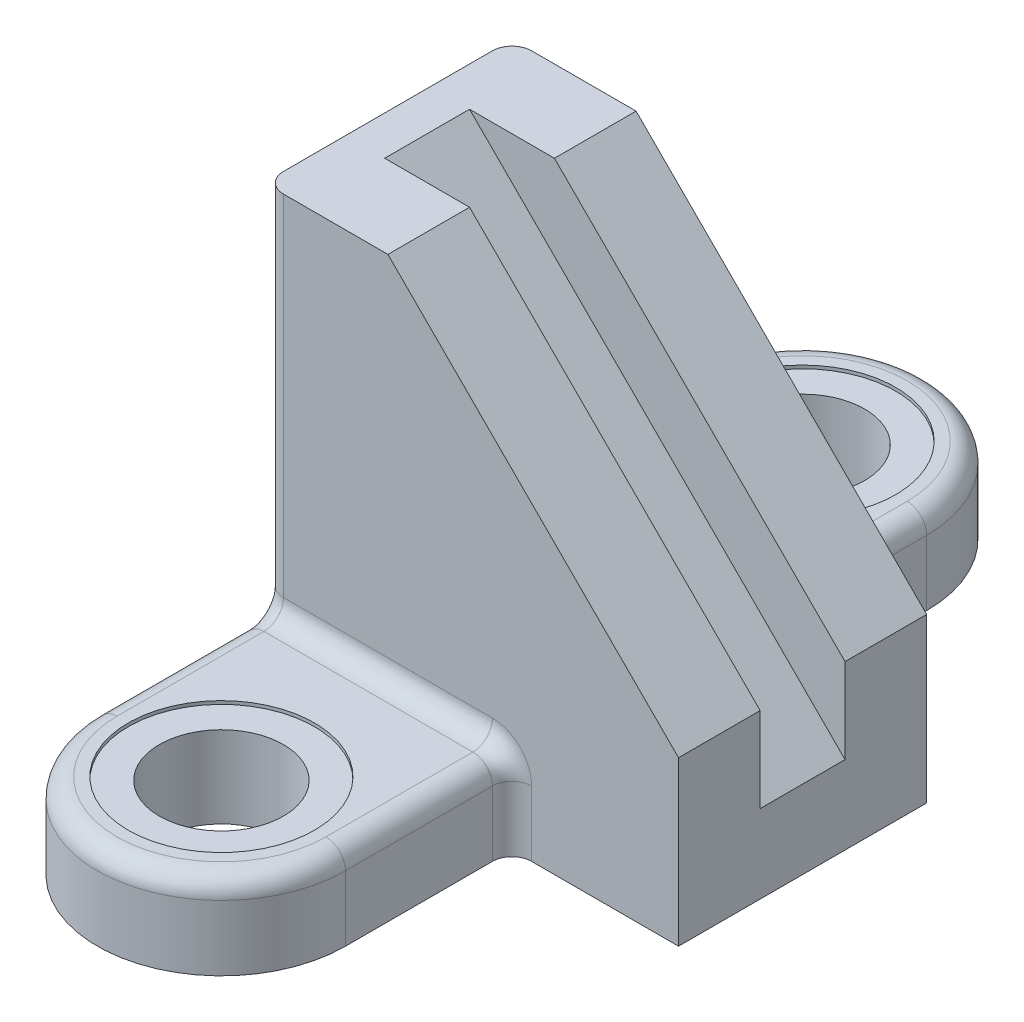
ISO-10303-21;
HEADER;
FILE_DESCRIPTION(('STEP AP214'),'2;1');
FILE_NAME('part.step','',(''),(''),'','','');
FILE_SCHEMA(('AUTOMOTIVE_DESIGN { 1 0 10303 214 1 1 1 1 }'));
ENDSEC;
DATA;
#1=APPLICATION_CONTEXT('core data for automotive mechanical design processes');
#2=APPLICATION_PROTOCOL_DEFINITION('international standard','automotive_design',2000,#1);
#3=PRODUCT_CONTEXT('',#1,'mechanical');
#4=PRODUCT('Part','Part','',(#3));
#5=PRODUCT_RELATED_PRODUCT_CATEGORY('part','',(#4));
#6=PRODUCT_DEFINITION_FORMATION('','',#4);
#7=PRODUCT_DEFINITION_CONTEXT('part definition',#1,'design');
#8=PRODUCT_DEFINITION('design','',#6,#7);
#9=PRODUCT_DEFINITION_SHAPE('','',#8);
#10=(LENGTH_UNIT() NAMED_UNIT(*) SI_UNIT(.MILLI.,.METRE.));
#11=(NAMED_UNIT(*) PLANE_ANGLE_UNIT() SI_UNIT($,.RADIAN.));
#12=(NAMED_UNIT(*) SI_UNIT($,.STERADIAN.) SOLID_ANGLE_UNIT());
#13=UNCERTAINTY_MEASURE_WITH_UNIT(LENGTH_MEASURE(1.E-05),#10,'distance_accuracy_value','');
#14=(GEOMETRIC_REPRESENTATION_CONTEXT(3) GLOBAL_UNCERTAINTY_ASSIGNED_CONTEXT((#13)) GLOBAL_UNIT_ASSIGNED_CONTEXT((#10,
#11,#12)) REPRESENTATION_CONTEXT('',''));
#15=CARTESIAN_POINT('',(0.,0.,0.));
#16=DIRECTION('',(0.,0.,1.));
#17=DIRECTION('',(1.,0.,0.));
#18=AXIS2_PLACEMENT_3D('',#15,#16,#17);
#19=CARTESIAN_POINT('',(38.,138.999999999999,38.));
#20=DIRECTION('',(-0.707106781186544,-0.707106781186551,0.));
#21=DIRECTION('',(0.707106781186551,-0.707106781186544,0.));
#22=AXIS2_PLACEMENT_3D('',#19,#20,#21);
#23=PLANE('',#22);
#24=DIRECTION('',(0.,0.,-1.));
#25=VECTOR('',#24,1.);
#26=CARTESIAN_POINT('',(127.,50.,38.));
#27=LINE('',#26,#25);
#28=CARTESIAN_POINT('',(127.,50.,38.));
#29=VERTEX_POINT('',#28);
#30=CARTESIAN_POINT('',(127.,49.9999999999997,13.));
#31=VERTEX_POINT('',#30);
#32=EDGE_CURVE('E232',#29,#31,#27,.T.);
#33=ORIENTED_EDGE('',*,*,#32,.T.);
#34=DIRECTION('',(-0.707106781186549,0.707106781186546,0.));
#35=VECTOR('',#34,1.);
#36=CARTESIAN_POINT('',(152.,24.9999999999998,13.));
#37=LINE('',#36,#35);
#38=CARTESIAN_POINT('',(38.0000000000001,138.999999999999,13.));
#39=VERTEX_POINT('',#38);
#40=EDGE_CURVE('E218',#31,#39,#37,.T.);
#41=ORIENTED_EDGE('',*,*,#40,.T.);
#42=DIRECTION('',(0.,0.,-1.));
#43=VECTOR('',#42,1.);
#44=CARTESIAN_POINT('',(38.,138.999999999999,38.));
#45=LINE('',#44,#43);
#46=CARTESIAN_POINT('',(38.,138.999999999999,38.));
#47=VERTEX_POINT('',#46);
#48=EDGE_CURVE('E224',#47,#39,#45,.T.);
#49=ORIENTED_EDGE('',*,*,#48,.F.);
#50=DIRECTION('',(-0.707106781186551,0.707106781186544,0.));
#51=VECTOR('',#50,1.);
#52=CARTESIAN_POINT('',(38.,138.999999999999,38.));
#53=LINE('',#52,#51);
#54=EDGE_CURVE('E393',#29,#47,#53,.T.);
#55=ORIENTED_EDGE('',*,*,#54,.F.);
#56=EDGE_LOOP('',(#33,#41,#49,#55));
#57=FACE_BOUND('',#56,.T.);
#58=ADVANCED_FACE('F37',(#57),#23,.F.);
#59=CARTESIAN_POINT('',(0.,0.,38.));
#60=DIRECTION('',(0.,0.,-1.));
#61=DIRECTION('',(-1.,0.,0.));
#62=AXIS2_PLACEMENT_3D('',#59,#60,#61);
#63=PLANE('',#62);
#64=CARTESIAN_POINT('',(70.,20.,38.));
#65=DIRECTION('',(0.,0.,-1.));
#66=DIRECTION('',(-1.,0.,0.));
#67=AXIS2_PLACEMENT_3D('',#64,#65,#66);
#68=CIRCLE('',#67,12.);
#69=CARTESIAN_POINT('',(82.,20.,38.));
#70=VERTEX_POINT('',#69);
#71=CARTESIAN_POINT('',(70.,32.,38.));
#72=VERTEX_POINT('',#71);
#73=EDGE_CURVE('E263',#70,#72,#68,.F.);
#74=ORIENTED_EDGE('',*,*,#73,.F.);
#75=DIRECTION('',(0.,-1.,0.));
#76=VECTOR('',#75,1.);
#77=CARTESIAN_POINT('',(82.,0.,38.));
#78=LINE('',#77,#76);
#79=CARTESIAN_POINT('',(82.,0.,38.));
#80=VERTEX_POINT('',#79);
#81=EDGE_CURVE('E266',#70,#80,#78,.T.);
#82=ORIENTED_EDGE('',*,*,#81,.T.);
#83=DIRECTION('',(1.,0.,0.));
#84=VECTOR('',#83,1.);
#85=CARTESIAN_POINT('',(0.,0.,38.));
#86=LINE('',#85,#84);
#87=CARTESIAN_POINT('',(127.,0.,38.));
#88=VERTEX_POINT('',#87);
#89=EDGE_CURVE('E384',#80,#88,#86,.T.);
#90=ORIENTED_EDGE('',*,*,#89,.T.);
#91=DIRECTION('',(0.,1.,0.));
#92=VECTOR('',#91,1.);
#93=CARTESIAN_POINT('',(127.,0.,38.));
#94=LINE('',#93,#92);
#95=EDGE_CURVE('E385',#88,#29,#94,.T.);
#96=ORIENTED_EDGE('',*,*,#95,.T.);
#97=ORIENTED_EDGE('',*,*,#54,.T.);
#98=DIRECTION('',(-1.,0.,0.));
#99=VECTOR('',#98,1.);
#100=CARTESIAN_POINT('',(0.,138.999999999999,38.));
#101=LINE('',#100,#99);
#102=CARTESIAN_POINT('',(6.,138.999999999999,38.));
#103=VERTEX_POINT('',#102);
#104=EDGE_CURVE('E226',#47,#103,#101,.T.);
#105=ORIENTED_EDGE('',*,*,#104,.T.);
#106=DIRECTION('',(0.,-1.,0.));
#107=VECTOR('',#106,1.);
#108=CARTESIAN_POINT('',(6.,0.,38.));
#109=LINE('',#108,#107);
#110=CARTESIAN_POINT('',(6.,32.,38.));
#111=VERTEX_POINT('',#110);
#112=EDGE_CURVE('E259',#103,#111,#109,.T.);
#113=ORIENTED_EDGE('',*,*,#112,.T.);
#114=DIRECTION('',(-1.,0.,0.));
#115=VECTOR('',#114,1.);
#116=CARTESIAN_POINT('',(0.,32.,38.));
#117=LINE('',#116,#115);
#118=EDGE_CURVE('E261',#111,#72,#117,.F.);
#119=ORIENTED_EDGE('',*,*,#118,.T.);
#120=EDGE_LOOP('',(#74,#82,#90,#96,#97,#105,#113,#119));
#121=FACE_BOUND('',#120,.T.);
#122=ADVANCED_FACE('F491',(#121),#63,.F.);
#123=CARTESIAN_POINT('',(0.,0.,38.));
#124=DIRECTION('',(1.,0.,0.));
#125=DIRECTION('',(0.,0.,-1.));
#126=AXIS2_PLACEMENT_3D('',#123,#124,#125);
#127=PLANE('',#126);
#128=CARTESIAN_POINT('',(0.,32.,-44.));
#129=DIRECTION('',(1.,0.,0.));
#130=DIRECTION('',(0.,0.,-1.));
#131=AXIS2_PLACEMENT_3D('',#128,#129,#130);
#132=CIRCLE('',#131,12.);
#133=CARTESIAN_POINT('',(0.,20.,-44.));
#134=VERTEX_POINT('',#133);
#135=CARTESIAN_POINT('',(0.,32.,-32.));
#136=VERTEX_POINT('',#135);
#137=EDGE_CURVE('E289',#134,#136,#132,.F.);
#138=ORIENTED_EDGE('',*,*,#137,.F.);
#139=DIRECTION('',(0.,0.,1.));
#140=VECTOR('',#139,1.);
#141=CARTESIAN_POINT('',(0.,20.,38.));
#142=LINE('',#141,#140);
#143=CARTESIAN_POINT('',(0.,20.,-89.));
#144=VERTEX_POINT('',#143);
#145=EDGE_CURVE('E294',#134,#144,#142,.F.);
#146=ORIENTED_EDGE('',*,*,#145,.T.);
#147=DIRECTION('',(0.,-1.,0.));
#148=VECTOR('',#147,1.);
#149=CARTESIAN_POINT('',(0.,26.,-89.));
#150=LINE('',#149,#148);
#151=CARTESIAN_POINT('',(0.,0.,-89.));
#152=VERTEX_POINT('',#151);
#153=EDGE_CURVE('E397',#144,#152,#150,.T.);
#154=ORIENTED_EDGE('',*,*,#153,.T.);
#155=DIRECTION('',(0.,0.,-1.));
#156=VECTOR('',#155,1.);
#157=CARTESIAN_POINT('',(0.,0.,38.));
#158=LINE('',#157,#156);
#159=CARTESIAN_POINT('',(0.,0.,89.));
#160=VERTEX_POINT('',#159);
#161=EDGE_CURVE('E242',#160,#152,#158,.T.);
#162=ORIENTED_EDGE('',*,*,#161,.F.);
#163=DIRECTION('',(0.,-1.,0.));
#164=VECTOR('',#163,1.);
#165=CARTESIAN_POINT('',(0.,26.,89.));
#166=LINE('',#165,#164);
#167=CARTESIAN_POINT('',(0.,20.,89.));
#168=VERTEX_POINT('',#167);
#169=EDGE_CURVE('E405',#168,#160,#166,.T.);
#170=ORIENTED_EDGE('',*,*,#169,.F.);
#171=DIRECTION('',(0.,0.,1.));
#172=VECTOR('',#171,1.);
#173=CARTESIAN_POINT('',(0.,20.,38.));
#174=LINE('',#173,#172);
#175=CARTESIAN_POINT('',(0.,20.,44.));
#176=VERTEX_POINT('',#175);
#177=EDGE_CURVE('E287',#168,#176,#174,.F.);
#178=ORIENTED_EDGE('',*,*,#177,.T.);
#179=CARTESIAN_POINT('',(0.,32.,44.));
#180=DIRECTION('',(1.,0.,0.));
#181=DIRECTION('',(0.,0.,-1.));
#182=AXIS2_PLACEMENT_3D('',#179,#180,#181);
#183=CIRCLE('',#182,12.);
#184=CARTESIAN_POINT('',(0.,32.,32.));
#185=VERTEX_POINT('',#184);
#186=EDGE_CURVE('E284',#185,#176,#183,.F.);
#187=ORIENTED_EDGE('',*,*,#186,.F.);
#188=DIRECTION('',(0.,-1.,0.));
#189=VECTOR('',#188,1.);
#190=CARTESIAN_POINT('',(0.,0.,32.));
#191=LINE('',#190,#189);
#192=CARTESIAN_POINT('',(0.,138.999999999999,32.));
#193=VERTEX_POINT('',#192);
#194=EDGE_CURVE('E282',#185,#193,#191,.F.);
#195=ORIENTED_EDGE('',*,*,#194,.T.);
#196=DIRECTION('',(0.,0.,-1.));
#197=VECTOR('',#196,1.);
#198=CARTESIAN_POINT('',(0.,138.999999999999,38.));
#199=LINE('',#198,#197);
#200=CARTESIAN_POINT('',(0.,138.999999999999,-32.));
#201=VERTEX_POINT('',#200);
#202=EDGE_CURVE('E234',#193,#201,#199,.T.);
#203=ORIENTED_EDGE('',*,*,#202,.T.);
#204=DIRECTION('',(0.,-1.,0.));
#205=VECTOR('',#204,1.);
#206=CARTESIAN_POINT('',(0.,26.,-32.));
#207=LINE('',#206,#205);
#208=EDGE_CURVE('E292',#201,#136,#207,.T.);
#209=ORIENTED_EDGE('',*,*,#208,.T.);
#210=EDGE_LOOP('',(#138,#146,#154,#162,#170,#178,#187,#195,#203,#209));
#211=FACE_BOUND('',#210,.T.);
#212=ADVANCED_FACE('F475',(#211),#127,.F.);
#213=CARTESIAN_POINT('',(0.,0.,38.));
#214=DIRECTION('',(0.,1.,0.));
#215=DIRECTION('',(0.,0.,1.));
#216=AXIS2_PLACEMENT_3D('',#213,#214,#215);
#217=PLANE('',#216);
#218=CARTESIAN_POINT('',(38.,0.,89.));
#219=DIRECTION('',(0.,1.,0.));
#220=DIRECTION('',(0.,0.,1.));
#221=AXIS2_PLACEMENT_3D('',#218,#219,#220);
#222=CIRCLE('',#221,19.);
#223=CARTESIAN_POINT('',(38.,0.,108.));
#224=VERTEX_POINT('',#223);
#225=EDGE_CURVE('E425',#224,#224,#222,.T.);
#226=ORIENTED_EDGE('',*,*,#225,.T.);
#227=EDGE_LOOP('',(#226));
#228=FACE_BOUND('',#227,.T.);
#229=CARTESIAN_POINT('',(38.,0.,-89.));
#230=DIRECTION('',(0.,1.,0.));
#231=DIRECTION('',(0.,0.,1.));
#232=AXIS2_PLACEMENT_3D('',#229,#230,#231);
#233=CIRCLE('',#232,19.);
#234=CARTESIAN_POINT('',(38.,0.,-70.));
#235=VERTEX_POINT('',#234);
#236=EDGE_CURVE('E344',#235,#235,#233,.T.);
#237=ORIENTED_EDGE('',*,*,#236,.T.);
#238=EDGE_LOOP('',(#237));
#239=FACE_BOUND('',#238,.T.);
#240=ORIENTED_EDGE('',*,*,#161,.T.);
#241=CARTESIAN_POINT('',(38.,0.,-89.));
#242=DIRECTION('',(0.,1.,0.));
#243=DIRECTION('',(0.,0.,-1.));
#244=AXIS2_PLACEMENT_3D('',#241,#242,#243);
#245=CIRCLE('',#244,38.);
#246=CARTESIAN_POINT('',(76.,0.,-89.));
#247=VERTEX_POINT('',#246);
#248=EDGE_CURVE('E399',#247,#152,#245,.T.);
#249=ORIENTED_EDGE('',*,*,#248,.F.);
#250=DIRECTION('',(0.,0.,-1.));
#251=VECTOR('',#250,1.);
#252=CARTESIAN_POINT('',(76.,0.,-38.));
#253=LINE('',#252,#251);
#254=CARTESIAN_POINT('',(76.,0.,-44.));
#255=VERTEX_POINT('',#254);
#256=EDGE_CURVE('E402',#255,#247,#253,.T.);
#257=ORIENTED_EDGE('',*,*,#256,.F.);
#258=CARTESIAN_POINT('',(82.,0.,-44.));
#259=DIRECTION('',(0.,1.,0.));
#260=DIRECTION('',(0.,0.,1.));
#261=AXIS2_PLACEMENT_3D('',#258,#259,#260);
#262=CIRCLE('',#261,6.);
#263=CARTESIAN_POINT('',(82.,0.,-38.));
#264=VERTEX_POINT('',#263);
#265=EDGE_CURVE('E311',#255,#264,#262,.T.);
#266=ORIENTED_EDGE('',*,*,#265,.T.);
#267=DIRECTION('',(1.,0.,0.));
#268=VECTOR('',#267,1.);
#269=CARTESIAN_POINT('',(0.,0.,-38.));
#270=LINE('',#269,#268);
#271=CARTESIAN_POINT('',(127.,0.,-38.));
#272=VERTEX_POINT('',#271);
#273=EDGE_CURVE('E389',#264,#272,#270,.T.);
#274=ORIENTED_EDGE('',*,*,#273,.T.);
#275=DIRECTION('',(0.,0.,-1.));
#276=VECTOR('',#275,1.);
#277=CARTESIAN_POINT('',(127.,0.,38.));
#278=LINE('',#277,#276);
#279=EDGE_CURVE('E239',#88,#272,#278,.T.);
#280=ORIENTED_EDGE('',*,*,#279,.F.);
#281=ORIENTED_EDGE('',*,*,#89,.F.);
#282=CARTESIAN_POINT('',(82.,0.,44.));
#283=DIRECTION('',(0.,1.,0.));
#284=DIRECTION('',(0.,0.,1.));
#285=AXIS2_PLACEMENT_3D('',#282,#283,#284);
#286=CIRCLE('',#285,6.);
#287=CARTESIAN_POINT('',(76.,0.,44.));
#288=VERTEX_POINT('',#287);
#289=EDGE_CURVE('E313',#80,#288,#286,.T.);
#290=ORIENTED_EDGE('',*,*,#289,.T.);
#291=DIRECTION('',(0.,0.,-1.));
#292=VECTOR('',#291,1.);
#293=CARTESIAN_POINT('',(76.,0.,38.));
#294=LINE('',#293,#292);
#295=CARTESIAN_POINT('',(76.,0.,89.));
#296=VERTEX_POINT('',#295);
#297=EDGE_CURVE('E409',#296,#288,#294,.T.);
#298=ORIENTED_EDGE('',*,*,#297,.F.);
#299=CARTESIAN_POINT('',(38.,0.,89.));
#300=DIRECTION('',(0.,1.,0.));
#301=DIRECTION('',(0.,0.,1.));
#302=AXIS2_PLACEMENT_3D('',#299,#300,#301);
#303=CIRCLE('',#302,38.);
#304=EDGE_CURVE('E339',#160,#296,#303,.T.);
#305=ORIENTED_EDGE('',*,*,#304,.F.);
#306=EDGE_LOOP('',(#240,#249,#257,#266,#274,#280,#281,#290,#298,#305));
#307=FACE_BOUND('',#306,.T.);
#308=ADVANCED_FACE('F507',(#228,#239,#307),#217,.F.);
#309=CARTESIAN_POINT('',(127.,0.,38.));
#310=DIRECTION('',(-1.,0.,0.));
#311=DIRECTION('',(0.,0.,1.));
#312=AXIS2_PLACEMENT_3D('',#309,#310,#311);
#313=PLANE('',#312);
#314=DIRECTION('',(0.,0.,1.));
#315=VECTOR('',#314,1.);
#316=CARTESIAN_POINT('',(127.,23.9999999999994,38.));
#317=LINE('',#316,#315);
#318=CARTESIAN_POINT('',(127.,23.9999999999995,-13.));
#319=VERTEX_POINT('',#318);
#320=CARTESIAN_POINT('',(127.,23.9999999999994,13.));
#321=VERTEX_POINT('',#320);
#322=EDGE_CURVE('E438',#319,#321,#317,.T.);
#323=ORIENTED_EDGE('',*,*,#322,.T.);
#324=DIRECTION('',(0.,1.,0.));
#325=VECTOR('',#324,1.);
#326=CARTESIAN_POINT('',(127.,0.,13.));
#327=LINE('',#326,#325);
#328=EDGE_CURVE('E209',#321,#31,#327,.T.);
#329=ORIENTED_EDGE('',*,*,#328,.T.);
#330=ORIENTED_EDGE('',*,*,#32,.F.);
#331=ORIENTED_EDGE('',*,*,#95,.F.);
#332=ORIENTED_EDGE('',*,*,#279,.T.);
#333=DIRECTION('',(0.,1.,0.));
#334=VECTOR('',#333,1.);
#335=CARTESIAN_POINT('',(127.,0.,-38.));
#336=LINE('',#335,#334);
#337=CARTESIAN_POINT('',(127.,50.,-38.));
#338=VERTEX_POINT('',#337);
#339=EDGE_CURVE('E378',#272,#338,#336,.T.);
#340=ORIENTED_EDGE('',*,*,#339,.T.);
#341=CARTESIAN_POINT('',(127.,49.9999999999997,-13.));
#342=VERTEX_POINT('',#341);
#343=EDGE_CURVE('E229',#342,#338,#27,.T.);
#344=ORIENTED_EDGE('',*,*,#343,.F.);
#345=DIRECTION('',(0.,-1.,0.));
#346=VECTOR('',#345,1.);
#347=CARTESIAN_POINT('',(127.,0.,-13.));
#348=LINE('',#347,#346);
#349=EDGE_CURVE('E211',#342,#319,#348,.T.);
#350=ORIENTED_EDGE('',*,*,#349,.T.);
#351=EDGE_LOOP('',(#323,#329,#330,#331,#332,#340,#344,#350));
#352=FACE_BOUND('',#351,.T.);
#353=ADVANCED_FACE('F446',(#352),#313,.F.);
#354=CARTESIAN_POINT('',(38.0000000000001,138.999999999999,-13.));
#355=VERTEX_POINT('',#354);
#356=CARTESIAN_POINT('',(38.,138.999999999999,-38.));
#357=VERTEX_POINT('',#356);
#358=EDGE_CURVE('E230',#355,#357,#45,.T.);
#359=ORIENTED_EDGE('',*,*,#358,.F.);
#360=DIRECTION('',(-0.707106781186549,0.707106781186546,0.));
#361=VECTOR('',#360,1.);
#362=CARTESIAN_POINT('',(152.,24.9999999999998,-13.));
#363=LINE('',#362,#361);
#364=EDGE_CURVE('E369',#342,#355,#363,.T.);
#365=ORIENTED_EDGE('',*,*,#364,.F.);
#366=ORIENTED_EDGE('',*,*,#343,.T.);
#367=DIRECTION('',(-0.707106781186551,0.707106781186544,0.));
#368=VECTOR('',#367,1.);
#369=CARTESIAN_POINT('',(38.,138.999999999999,-38.));
#370=LINE('',#369,#368);
#371=EDGE_CURVE('E372',#338,#357,#370,.T.);
#372=ORIENTED_EDGE('',*,*,#371,.T.);
#373=EDGE_LOOP('',(#359,#365,#366,#372));
#374=FACE_BOUND('',#373,.T.);
#375=ADVANCED_FACE('F368',(#374),#23,.F.);
#376=CARTESIAN_POINT('',(0.,138.999999999999,38.));
#377=DIRECTION('',(0.,-1.,0.));
#378=DIRECTION('',(0.,0.,-1.));
#379=AXIS2_PLACEMENT_3D('',#376,#377,#378);
#380=PLANE('',#379);
#381=ORIENTED_EDGE('',*,*,#48,.T.);
#382=DIRECTION('',(-1.,0.,0.));
#383=VECTOR('',#382,1.);
#384=CARTESIAN_POINT('',(0.,138.999999999999,13.));
#385=LINE('',#384,#383);
#386=CARTESIAN_POINT('',(12.,138.999999999999,13.));
#387=VERTEX_POINT('',#386);
#388=EDGE_CURVE('E11',#39,#387,#385,.T.);
#389=ORIENTED_EDGE('',*,*,#388,.T.);
#390=DIRECTION('',(0.,0.,1.));
#391=VECTOR('',#390,1.);
#392=CARTESIAN_POINT('',(12.,138.999999999999,13.));
#393=LINE('',#392,#391);
#394=CARTESIAN_POINT('',(11.9999999999999,138.999999999999,-13.));
#395=VERTEX_POINT('',#394);
#396=EDGE_CURVE('E214',#395,#387,#393,.T.);
#397=ORIENTED_EDGE('',*,*,#396,.F.);
#398=DIRECTION('',(1.,0.,0.));
#399=VECTOR('',#398,1.);
#400=CARTESIAN_POINT('',(0.,138.999999999999,-13.));
#401=LINE('',#400,#399);
#402=EDGE_CURVE('E45',#395,#355,#401,.T.);
#403=ORIENTED_EDGE('',*,*,#402,.T.);
#404=ORIENTED_EDGE('',*,*,#358,.T.);
#405=DIRECTION('',(-1.,0.,0.));
#406=VECTOR('',#405,1.);
#407=CARTESIAN_POINT('',(0.,138.999999999999,-38.));
#408=LINE('',#407,#406);
#409=CARTESIAN_POINT('',(6.,138.999999999999,-38.));
#410=VERTEX_POINT('',#409);
#411=EDGE_CURVE('E377',#357,#410,#408,.T.);
#412=ORIENTED_EDGE('',*,*,#411,.T.);
#413=CARTESIAN_POINT('',(6.,138.999999999999,-32.));
#414=DIRECTION('',(0.,-1.,0.));
#415=DIRECTION('',(0.,0.,-1.));
#416=AXIS2_PLACEMENT_3D('',#413,#414,#415);
#417=CIRCLE('',#416,6.);
#418=EDGE_CURVE('E309',#410,#201,#417,.F.);
#419=ORIENTED_EDGE('',*,*,#418,.T.);
#420=ORIENTED_EDGE('',*,*,#202,.F.);
#421=CARTESIAN_POINT('',(6.,138.999999999999,32.));
#422=DIRECTION('',(0.,-1.,0.));
#423=DIRECTION('',(0.,0.,-1.));
#424=AXIS2_PLACEMENT_3D('',#421,#422,#423);
#425=CIRCLE('',#424,6.);
#426=EDGE_CURVE('E307',#193,#103,#425,.F.);
#427=ORIENTED_EDGE('',*,*,#426,.T.);
#428=ORIENTED_EDGE('',*,*,#104,.F.);
#429=EDGE_LOOP('',(#381,#389,#397,#403,#404,#412,#419,#420,#427,#428));
#430=FACE_BOUND('',#429,.T.);
#431=ADVANCED_FACE('F221',(#430),#380,.F.);
#432=CARTESIAN_POINT('',(0.,0.,-38.));
#433=DIRECTION('',(0.,0.,-1.));
#434=DIRECTION('',(-1.,0.,0.));
#435=AXIS2_PLACEMENT_3D('',#432,#433,#434);
#436=PLANE('',#435);
#437=ORIENTED_EDGE('',*,*,#273,.F.);
#438=DIRECTION('',(0.,-1.,0.));
#439=VECTOR('',#438,1.);
#440=CARTESIAN_POINT('',(82.,0.,-38.));
#441=LINE('',#440,#439);
#442=CARTESIAN_POINT('',(82.,20.,-38.));
#443=VERTEX_POINT('',#442);
#444=EDGE_CURVE('E257',#264,#443,#441,.F.);
#445=ORIENTED_EDGE('',*,*,#444,.T.);
#446=CARTESIAN_POINT('',(70.,20.,-38.));
#447=DIRECTION('',(0.,0.,-1.));
#448=DIRECTION('',(-1.,0.,0.));
#449=AXIS2_PLACEMENT_3D('',#446,#447,#448);
#450=CIRCLE('',#449,12.);
#451=CARTESIAN_POINT('',(70.,32.,-38.));
#452=VERTEX_POINT('',#451);
#453=EDGE_CURVE('E254',#452,#443,#450,.T.);
#454=ORIENTED_EDGE('',*,*,#453,.F.);
#455=DIRECTION('',(1.,0.,0.));
#456=VECTOR('',#455,1.);
#457=CARTESIAN_POINT('',(0.,32.,-38.));
#458=LINE('',#457,#456);
#459=CARTESIAN_POINT('',(6.,32.,-38.));
#460=VERTEX_POINT('',#459);
#461=EDGE_CURVE('E250',#452,#460,#458,.F.);
#462=ORIENTED_EDGE('',*,*,#461,.T.);
#463=DIRECTION('',(0.,-1.,0.));
#464=VECTOR('',#463,1.);
#465=CARTESIAN_POINT('',(6.,138.999999999999,-38.));
#466=LINE('',#465,#464);
#467=EDGE_CURVE('E252',#460,#410,#466,.F.);
#468=ORIENTED_EDGE('',*,*,#467,.T.);
#469=ORIENTED_EDGE('',*,*,#411,.F.);
#470=ORIENTED_EDGE('',*,*,#371,.F.);
#471=ORIENTED_EDGE('',*,*,#339,.F.);
#472=EDGE_LOOP('',(#437,#445,#454,#462,#468,#469,#470,#471));
#473=FACE_BOUND('',#472,.T.);
#474=ADVANCED_FACE('F381',(#473),#436,.T.);
#475=CARTESIAN_POINT('',(76.,26.,-38.));
#476=DIRECTION('',(-1.,0.,0.));
#477=DIRECTION('',(0.,0.,1.));
#478=AXIS2_PLACEMENT_3D('',#475,#476,#477);
#479=PLANE('',#478);
#480=DIRECTION('',(0.,0.,-1.));
#481=VECTOR('',#480,1.);
#482=CARTESIAN_POINT('',(76.,20.,-38.));
#483=LINE('',#482,#481);
#484=CARTESIAN_POINT('',(76.,20.,-89.));
#485=VERTEX_POINT('',#484);
#486=CARTESIAN_POINT('',(76.,20.,-44.));
#487=VERTEX_POINT('',#486);
#488=EDGE_CURVE('E245',#485,#487,#483,.F.);
#489=ORIENTED_EDGE('',*,*,#488,.T.);
#490=DIRECTION('',(0.,-1.,0.));
#491=VECTOR('',#490,1.);
#492=CARTESIAN_POINT('',(76.,26.,-44.));
#493=LINE('',#492,#491);
#494=EDGE_CURVE('E247',#487,#255,#493,.T.);
#495=ORIENTED_EDGE('',*,*,#494,.T.);
#496=ORIENTED_EDGE('',*,*,#256,.T.);
#497=DIRECTION('',(0.,-1.,0.));
#498=VECTOR('',#497,1.);
#499=CARTESIAN_POINT('',(76.,26.,-89.));
#500=LINE('',#499,#498);
#501=EDGE_CURVE('E391',#485,#247,#500,.T.);
#502=ORIENTED_EDGE('',*,*,#501,.F.);
#503=EDGE_LOOP('',(#489,#495,#496,#502));
#504=FACE_BOUND('',#503,.T.);
#505=ADVANCED_FACE('F595',(#504),#479,.F.);
#506=CARTESIAN_POINT('',(38.,26.,-89.));
#507=DIRECTION('',(0.,-1.,0.));
#508=DIRECTION('',(0.,0.,-1.));
#509=AXIS2_PLACEMENT_3D('',#506,#507,#508);
#510=CYLINDRICAL_SURFACE('',#509,38.);
#511=ORIENTED_EDGE('',*,*,#153,.F.);
#512=CARTESIAN_POINT('',(38.,20.,-89.));
#513=DIRECTION('',(0.,-1.,0.));
#514=DIRECTION('',(0.,0.,-1.));
#515=AXIS2_PLACEMENT_3D('',#512,#513,#514);
#516=CIRCLE('',#515,38.);
#517=EDGE_CURVE('E305',#144,#485,#516,.T.);
#518=ORIENTED_EDGE('',*,*,#517,.T.);
#519=ORIENTED_EDGE('',*,*,#501,.T.);
#520=ORIENTED_EDGE('',*,*,#248,.T.);
#521=EDGE_LOOP('',(#511,#518,#519,#520));
#522=FACE_BOUND('',#521,.T.);
#523=ADVANCED_FACE('F589',(#522),#510,.T.);
#524=CARTESIAN_POINT('',(38.,26.,-89.));
#525=DIRECTION('',(0.,-1.,0.));
#526=DIRECTION('',(0.,0.,-1.));
#527=AXIS2_PLACEMENT_3D('',#524,#525,#526);
#528=PLANE('',#527);
#529=CARTESIAN_POINT('',(38.,26.,-89.));
#530=DIRECTION('',(0.,1.,0.));
#531=DIRECTION('',(0.,0.,1.));
#532=AXIS2_PLACEMENT_3D('',#529,#530,#531);
#533=CIRCLE('',#532,28.5);
#534=CARTESIAN_POINT('',(38.,26.,-60.5));
#535=VERTEX_POINT('',#534);
#536=EDGE_CURVE('E422',#535,#535,#533,.T.);
#537=ORIENTED_EDGE('',*,*,#536,.F.);
#538=EDGE_LOOP('',(#537));
#539=FACE_BOUND('',#538,.T.);
#540=DIRECTION('',(0.,0.,-1.));
#541=VECTOR('',#540,1.);
#542=CARTESIAN_POINT('',(70.,26.,-89.));
#543=LINE('',#542,#541);
#544=CARTESIAN_POINT('',(70.,26.,-44.));
#545=VERTEX_POINT('',#544);
#546=CARTESIAN_POINT('',(70.,26.,-89.));
#547=VERTEX_POINT('',#546);
#548=EDGE_CURVE('E277',#545,#547,#543,.T.);
#549=ORIENTED_EDGE('',*,*,#548,.T.);
#550=CARTESIAN_POINT('',(38.,26.,-89.));
#551=DIRECTION('',(0.,-1.,0.));
#552=DIRECTION('',(0.,0.,-1.));
#553=AXIS2_PLACEMENT_3D('',#550,#551,#552);
#554=CIRCLE('',#553,32.);
#555=CARTESIAN_POINT('',(6.,26.,-89.));
#556=VERTEX_POINT('',#555);
#557=EDGE_CURVE('E280',#547,#556,#554,.F.);
#558=ORIENTED_EDGE('',*,*,#557,.T.);
#559=DIRECTION('',(0.,0.,1.));
#560=VECTOR('',#559,1.);
#561=CARTESIAN_POINT('',(6.,26.,-89.));
#562=LINE('',#561,#560);
#563=CARTESIAN_POINT('',(6.,26.,-44.));
#564=VERTEX_POINT('',#563);
#565=EDGE_CURVE('E275',#556,#564,#562,.T.);
#566=ORIENTED_EDGE('',*,*,#565,.T.);
#567=DIRECTION('',(1.,0.,0.));
#568=VECTOR('',#567,1.);
#569=CARTESIAN_POINT('',(38.,26.,-44.));
#570=LINE('',#569,#568);
#571=EDGE_CURVE('E273',#564,#545,#570,.T.);
#572=ORIENTED_EDGE('',*,*,#571,.T.);
#573=EDGE_LOOP('',(#549,#558,#566,#572));
#574=FACE_BOUND('',#573,.T.);
#575=ADVANCED_FACE('F600',(#539,#574),#528,.F.);
#576=CARTESIAN_POINT('',(38.,26.,89.));
#577=DIRECTION('',(0.,-1.,0.));
#578=DIRECTION('',(0.,0.,-1.));
#579=AXIS2_PLACEMENT_3D('',#576,#577,#578);
#580=CYLINDRICAL_SURFACE('',#579,38.);
#581=DIRECTION('',(0.,-1.,0.));
#582=VECTOR('',#581,1.);
#583=CARTESIAN_POINT('',(76.,26.,89.));
#584=LINE('',#583,#582);
#585=CARTESIAN_POINT('',(76.,20.,89.));
#586=VERTEX_POINT('',#585);
#587=EDGE_CURVE('E407',#586,#296,#584,.T.);
#588=ORIENTED_EDGE('',*,*,#587,.F.);
#589=CARTESIAN_POINT('',(38.,20.,89.));
#590=DIRECTION('',(0.,1.,0.));
#591=DIRECTION('',(0.,0.,1.));
#592=AXIS2_PLACEMENT_3D('',#589,#590,#591);
#593=CIRCLE('',#592,38.);
#594=EDGE_CURVE('E303',#586,#168,#593,.F.);
#595=ORIENTED_EDGE('',*,*,#594,.T.);
#596=ORIENTED_EDGE('',*,*,#169,.T.);
#597=ORIENTED_EDGE('',*,*,#304,.T.);
#598=EDGE_LOOP('',(#588,#595,#596,#597));
#599=FACE_BOUND('',#598,.T.);
#600=ADVANCED_FACE('F582',(#599),#580,.T.);
#601=CARTESIAN_POINT('',(76.,26.,38.));
#602=DIRECTION('',(-1.,0.,0.));
#603=DIRECTION('',(0.,0.,1.));
#604=AXIS2_PLACEMENT_3D('',#601,#602,#603);
#605=PLANE('',#604);
#606=ORIENTED_EDGE('',*,*,#297,.T.);
#607=DIRECTION('',(0.,-1.,0.));
#608=VECTOR('',#607,1.);
#609=CARTESIAN_POINT('',(76.,26.,44.));
#610=LINE('',#609,#608);
#611=CARTESIAN_POINT('',(76.,20.,44.));
#612=VERTEX_POINT('',#611);
#613=EDGE_CURVE('E271',#288,#612,#610,.F.);
#614=ORIENTED_EDGE('',*,*,#613,.T.);
#615=DIRECTION('',(0.,0.,-1.));
#616=VECTOR('',#615,1.);
#617=CARTESIAN_POINT('',(76.,20.,89.));
#618=LINE('',#617,#616);
#619=EDGE_CURVE('E269',#612,#586,#618,.F.);
#620=ORIENTED_EDGE('',*,*,#619,.T.);
#621=ORIENTED_EDGE('',*,*,#587,.T.);
#622=EDGE_LOOP('',(#606,#614,#620,#621));
#623=FACE_BOUND('',#622,.T.);
#624=ADVANCED_FACE('F578',(#623),#605,.F.);
#625=CARTESIAN_POINT('',(38.,26.,89.));
#626=DIRECTION('',(0.,1.,0.));
#627=DIRECTION('',(0.,0.,1.));
#628=AXIS2_PLACEMENT_3D('',#625,#626,#627);
#629=PLANE('',#628);
#630=CARTESIAN_POINT('',(38.,26.,89.));
#631=DIRECTION('',(0.,1.,0.));
#632=DIRECTION('',(0.,0.,1.));
#633=AXIS2_PLACEMENT_3D('',#630,#631,#632);
#634=CIRCLE('',#633,28.5);
#635=CARTESIAN_POINT('',(38.,26.,117.5));
#636=VERTEX_POINT('',#635);
#637=EDGE_CURVE('E434',#636,#636,#634,.T.);
#638=ORIENTED_EDGE('',*,*,#637,.F.);
#639=EDGE_LOOP('',(#638));
#640=FACE_BOUND('',#639,.T.);
#641=CARTESIAN_POINT('',(38.,26.,89.));
#642=DIRECTION('',(0.,1.,0.));
#643=DIRECTION('',(0.,0.,1.));
#644=AXIS2_PLACEMENT_3D('',#641,#642,#643);
#645=CIRCLE('',#644,32.);
#646=CARTESIAN_POINT('',(6.,26.,89.));
#647=VERTEX_POINT('',#646);
#648=CARTESIAN_POINT('',(70.,26.,89.));
#649=VERTEX_POINT('',#648);
#650=EDGE_CURVE('E60',#647,#649,#645,.T.);
#651=ORIENTED_EDGE('',*,*,#650,.T.);
#652=DIRECTION('',(0.,0.,-1.));
#653=VECTOR('',#652,1.);
#654=CARTESIAN_POINT('',(70.,26.,38.));
#655=LINE('',#654,#653);
#656=CARTESIAN_POINT('',(70.,26.,44.));
#657=VERTEX_POINT('',#656);
#658=EDGE_CURVE('E301',#649,#657,#655,.T.);
#659=ORIENTED_EDGE('',*,*,#658,.T.);
#660=DIRECTION('',(-1.,0.,0.));
#661=VECTOR('',#660,1.);
#662=CARTESIAN_POINT('',(38.,26.,44.));
#663=LINE('',#662,#661);
#664=CARTESIAN_POINT('',(6.,26.,44.));
#665=VERTEX_POINT('',#664);
#666=EDGE_CURVE('E298',#657,#665,#663,.T.);
#667=ORIENTED_EDGE('',*,*,#666,.T.);
#668=DIRECTION('',(0.,0.,1.));
#669=VECTOR('',#668,1.);
#670=CARTESIAN_POINT('',(6.,26.,89.));
#671=LINE('',#670,#669);
#672=EDGE_CURVE('E296',#665,#647,#671,.T.);
#673=ORIENTED_EDGE('',*,*,#672,.T.);
#674=EDGE_LOOP('',(#651,#659,#667,#673));
#675=FACE_BOUND('',#674,.T.);
#676=ADVANCED_FACE('F538',(#640,#675),#629,.T.);
#677=CARTESIAN_POINT('',(6.,0.,-32.));
#678=DIRECTION('',(0.,1.,0.));
#679=DIRECTION('',(0.,0.,1.));
#680=AXIS2_PLACEMENT_3D('',#677,#678,#679);
#681=CYLINDRICAL_SURFACE('',#680,6.);
#682=ORIENTED_EDGE('',*,*,#418,.F.);
#683=ORIENTED_EDGE('',*,*,#467,.F.);
#684=CARTESIAN_POINT('',(6.,32.,-32.));
#685=DIRECTION('',(0.,-1.,0.));
#686=DIRECTION('',(0.,0.,-1.));
#687=AXIS2_PLACEMENT_3D('',#684,#685,#686);
#688=CIRCLE('',#687,6.);
#689=EDGE_CURVE('E336',#136,#460,#688,.T.);
#690=ORIENTED_EDGE('',*,*,#689,.F.);
#691=ORIENTED_EDGE('',*,*,#208,.F.);
#692=EDGE_LOOP('',(#682,#683,#690,#691));
#693=FACE_BOUND('',#692,.T.);
#694=ADVANCED_FACE('F470',(#693),#681,.T.);
#695=CARTESIAN_POINT('',(6.,20.,-89.));
#696=DIRECTION('',(0.,0.,1.));
#697=DIRECTION('',(1.,0.,0.));
#698=AXIS2_PLACEMENT_3D('',#695,#696,#697);
#699=CYLINDRICAL_SURFACE('',#698,6.);
#700=CARTESIAN_POINT('',(6.,20.,-89.));
#701=DIRECTION('',(0.,0.,-1.));
#702=DIRECTION('',(-1.,0.,0.));
#703=AXIS2_PLACEMENT_3D('',#700,#701,#702);
#704=CIRCLE('',#703,6.);
#705=EDGE_CURVE('E330',#144,#556,#704,.T.);
#706=ORIENTED_EDGE('',*,*,#705,.F.);
#707=ORIENTED_EDGE('',*,*,#145,.F.);
#708=CARTESIAN_POINT('',(6.,20.,-44.));
#709=DIRECTION('',(0.,0.,1.));
#710=DIRECTION('',(1.,0.,0.));
#711=AXIS2_PLACEMENT_3D('',#708,#709,#710);
#712=CIRCLE('',#711,6.);
#713=EDGE_CURVE('E333',#564,#134,#712,.T.);
#714=ORIENTED_EDGE('',*,*,#713,.F.);
#715=ORIENTED_EDGE('',*,*,#565,.F.);
#716=EDGE_LOOP('',(#706,#707,#714,#715));
#717=FACE_BOUND('',#716,.T.);
#718=ADVANCED_FACE('F532',(#717),#699,.T.);
#719=CARTESIAN_POINT('',(6.,32.,-44.));
#720=DIRECTION('',(1.,0.,0.));
#721=DIRECTION('',(0.,0.,-1.));
#722=AXIS2_PLACEMENT_3D('',#719,#720,#721);
#723=TOROIDAL_SURFACE('',#722,12.,6.);
#724=ORIENTED_EDGE('',*,*,#137,.T.);
#725=ORIENTED_EDGE('',*,*,#689,.T.);
#726=CARTESIAN_POINT('',(6.,32.,-44.));
#727=DIRECTION('',(1.,0.,0.));
#728=DIRECTION('',(0.,0.,-1.));
#729=AXIS2_PLACEMENT_3D('',#726,#727,#728);
#730=CIRCLE('',#729,6.);
#731=EDGE_CURVE('E327',#564,#460,#730,.F.);
#732=ORIENTED_EDGE('',*,*,#731,.F.);
#733=ORIENTED_EDGE('',*,*,#713,.T.);
#734=EDGE_LOOP('',(#724,#725,#732,#733));
#735=FACE_BOUND('',#734,.T.);
#736=ADVANCED_FACE('F465',(#735),#723,.T.);
#737=CARTESIAN_POINT('',(38.,20.,-89.));
#738=DIRECTION('',(0.,-1.,0.));
#739=DIRECTION('',(0.,0.,-1.));
#740=AXIS2_PLACEMENT_3D('',#737,#738,#739);
#741=TOROIDAL_SURFACE('',#740,32.,6.);
#742=ORIENTED_EDGE('',*,*,#705,.T.);
#743=ORIENTED_EDGE('',*,*,#557,.F.);
#744=CARTESIAN_POINT('',(70.,20.,-89.));
#745=DIRECTION('',(0.,0.,1.));
#746=DIRECTION('',(1.,0.,0.));
#747=AXIS2_PLACEMENT_3D('',#744,#745,#746);
#748=CIRCLE('',#747,6.);
#749=EDGE_CURVE('E325',#485,#547,#748,.T.);
#750=ORIENTED_EDGE('',*,*,#749,.F.);
#751=ORIENTED_EDGE('',*,*,#517,.F.);
#752=EDGE_LOOP('',(#742,#743,#750,#751));
#753=FACE_BOUND('',#752,.T.);
#754=ADVANCED_FACE('F526',(#753),#741,.T.);
#755=CARTESIAN_POINT('',(38.,32.,-44.));
#756=DIRECTION('',(1.,0.,0.));
#757=DIRECTION('',(0.,0.,-1.));
#758=AXIS2_PLACEMENT_3D('',#755,#756,#757);
#759=CYLINDRICAL_SURFACE('',#758,6.);
#760=ORIENTED_EDGE('',*,*,#731,.T.);
#761=ORIENTED_EDGE('',*,*,#461,.F.);
#762=CARTESIAN_POINT('',(70.,32.,-44.));
#763=DIRECTION('',(-1.,0.,0.));
#764=DIRECTION('',(0.,0.,1.));
#765=AXIS2_PLACEMENT_3D('',#762,#763,#764);
#766=CIRCLE('',#765,6.);
#767=EDGE_CURVE('E322',#545,#452,#766,.T.);
#768=ORIENTED_EDGE('',*,*,#767,.F.);
#769=ORIENTED_EDGE('',*,*,#571,.F.);
#770=EDGE_LOOP('',(#760,#761,#768,#769));
#771=FACE_BOUND('',#770,.T.);
#772=ADVANCED_FACE('F461',(#771),#759,.F.);
#773=CARTESIAN_POINT('',(70.,20.,-89.));
#774=DIRECTION('',(0.,0.,-1.));
#775=DIRECTION('',(-1.,0.,0.));
#776=AXIS2_PLACEMENT_3D('',#773,#774,#775);
#777=CYLINDRICAL_SURFACE('',#776,6.);
#778=ORIENTED_EDGE('',*,*,#749,.T.);
#779=ORIENTED_EDGE('',*,*,#548,.F.);
#780=CARTESIAN_POINT('',(70.,20.,-44.));
#781=DIRECTION('',(0.,0.,-1.));
#782=DIRECTION('',(-1.,0.,0.));
#783=AXIS2_PLACEMENT_3D('',#780,#781,#782);
#784=CIRCLE('',#783,6.);
#785=EDGE_CURVE('E318',#487,#545,#784,.F.);
#786=ORIENTED_EDGE('',*,*,#785,.F.);
#787=ORIENTED_EDGE('',*,*,#488,.F.);
#788=EDGE_LOOP('',(#778,#779,#786,#787));
#789=FACE_BOUND('',#788,.T.);
#790=ADVANCED_FACE('F520',(#789),#777,.T.);
#791=CARTESIAN_POINT('',(70.,20.,-44.));
#792=DIRECTION('',(0.,0.,-1.));
#793=DIRECTION('',(-1.,0.,0.));
#794=AXIS2_PLACEMENT_3D('',#791,#792,#793);
#795=TOROIDAL_SURFACE('',#794,12.,6.);
#796=ORIENTED_EDGE('',*,*,#767,.T.);
#797=ORIENTED_EDGE('',*,*,#453,.T.);
#798=CARTESIAN_POINT('',(82.,20.,-44.));
#799=DIRECTION('',(0.,-1.,0.));
#800=DIRECTION('',(0.,0.,-1.));
#801=AXIS2_PLACEMENT_3D('',#798,#799,#800);
#802=CIRCLE('',#801,6.);
#803=EDGE_CURVE('E315',#487,#443,#802,.F.);
#804=ORIENTED_EDGE('',*,*,#803,.F.);
#805=ORIENTED_EDGE('',*,*,#785,.T.);
#806=EDGE_LOOP('',(#796,#797,#804,#805));
#807=FACE_BOUND('',#806,.T.);
#808=ADVANCED_FACE('F456',(#807),#795,.F.);
#809=CARTESIAN_POINT('',(82.,26.,-44.));
#810=DIRECTION('',(0.,-1.,0.));
#811=DIRECTION('',(0.,0.,-1.));
#812=AXIS2_PLACEMENT_3D('',#809,#810,#811);
#813=CYLINDRICAL_SURFACE('',#812,6.);
#814=ORIENTED_EDGE('',*,*,#803,.T.);
#815=ORIENTED_EDGE('',*,*,#444,.F.);
#816=ORIENTED_EDGE('',*,*,#265,.F.);
#817=ORIENTED_EDGE('',*,*,#494,.F.);
#818=EDGE_LOOP('',(#814,#815,#816,#817));
#819=FACE_BOUND('',#818,.T.);
#820=ADVANCED_FACE('F452',(#819),#813,.F.);
#821=CARTESIAN_POINT('',(6.,20.,89.));
#822=DIRECTION('',(0.,0.,-1.));
#823=DIRECTION('',(-1.,0.,0.));
#824=AXIS2_PLACEMENT_3D('',#821,#822,#823);
#825=CYLINDRICAL_SURFACE('',#824,6.);
#826=CARTESIAN_POINT('',(6.,20.,44.));
#827=DIRECTION('',(0.,0.,-1.));
#828=DIRECTION('',(-1.,0.,0.));
#829=AXIS2_PLACEMENT_3D('',#826,#827,#828);
#830=CIRCLE('',#829,6.);
#831=EDGE_CURVE('E358',#176,#665,#830,.T.);
#832=ORIENTED_EDGE('',*,*,#831,.F.);
#833=ORIENTED_EDGE('',*,*,#177,.F.);
#834=CARTESIAN_POINT('',(6.,20.,89.));
#835=DIRECTION('',(0.,0.,1.));
#836=DIRECTION('',(1.,0.,0.));
#837=AXIS2_PLACEMENT_3D('',#834,#835,#836);
#838=CIRCLE('',#837,6.);
#839=EDGE_CURVE('E319',#647,#168,#838,.T.);
#840=ORIENTED_EDGE('',*,*,#839,.F.);
#841=ORIENTED_EDGE('',*,*,#672,.F.);
#842=EDGE_LOOP('',(#832,#833,#840,#841));
#843=FACE_BOUND('',#842,.T.);
#844=ADVANCED_FACE('F39',(#843),#825,.T.);
#845=CARTESIAN_POINT('',(6.,0.,32.));
#846=DIRECTION('',(0.,-1.,0.));
#847=DIRECTION('',(0.,0.,-1.));
#848=AXIS2_PLACEMENT_3D('',#845,#846,#847);
#849=CYLINDRICAL_SURFACE('',#848,6.);
#850=ORIENTED_EDGE('',*,*,#426,.F.);
#851=ORIENTED_EDGE('',*,*,#194,.F.);
#852=CARTESIAN_POINT('',(6.,32.,32.));
#853=DIRECTION('',(0.,-1.,0.));
#854=DIRECTION('',(0.,0.,-1.));
#855=AXIS2_PLACEMENT_3D('',#852,#853,#854);
#856=CIRCLE('',#855,6.);
#857=EDGE_CURVE('E355',#111,#185,#856,.T.);
#858=ORIENTED_EDGE('',*,*,#857,.F.);
#859=ORIENTED_EDGE('',*,*,#112,.F.);
#860=EDGE_LOOP('',(#850,#851,#858,#859));
#861=FACE_BOUND('',#860,.T.);
#862=ADVANCED_FACE('F479',(#861),#849,.T.);
#863=CARTESIAN_POINT('',(38.,20.,89.));
#864=DIRECTION('',(0.,1.,0.));
#865=DIRECTION('',(0.,0.,1.));
#866=AXIS2_PLACEMENT_3D('',#863,#864,#865);
#867=TOROIDAL_SURFACE('',#866,32.,6.);
#868=ORIENTED_EDGE('',*,*,#839,.T.);
#869=ORIENTED_EDGE('',*,*,#594,.F.);
#870=CARTESIAN_POINT('',(70.,20.,89.));
#871=DIRECTION('',(0.,0.,-1.));
#872=DIRECTION('',(-1.,0.,0.));
#873=AXIS2_PLACEMENT_3D('',#870,#871,#872);
#874=CIRCLE('',#873,6.);
#875=EDGE_CURVE('E352',#649,#586,#874,.T.);
#876=ORIENTED_EDGE('',*,*,#875,.F.);
#877=ORIENTED_EDGE('',*,*,#650,.F.);
#878=EDGE_LOOP('',(#868,#869,#876,#877));
#879=FACE_BOUND('',#878,.T.);
#880=ADVANCED_FACE('F556',(#879),#867,.T.);
#881=CARTESIAN_POINT('',(6.,32.,44.));
#882=DIRECTION('',(1.,0.,0.));
#883=DIRECTION('',(0.,0.,-1.));
#884=AXIS2_PLACEMENT_3D('',#881,#882,#883);
#885=TOROIDAL_SURFACE('',#884,12.,6.);
#886=ORIENTED_EDGE('',*,*,#186,.T.);
#887=ORIENTED_EDGE('',*,*,#831,.T.);
#888=CARTESIAN_POINT('',(6.,32.,44.));
#889=DIRECTION('',(1.,0.,0.));
#890=DIRECTION('',(0.,0.,-1.));
#891=AXIS2_PLACEMENT_3D('',#888,#889,#890);
#892=CIRCLE('',#891,6.);
#893=EDGE_CURVE('E349',#111,#665,#892,.F.);
#894=ORIENTED_EDGE('',*,*,#893,.F.);
#895=ORIENTED_EDGE('',*,*,#857,.T.);
#896=EDGE_LOOP('',(#886,#887,#894,#895));
#897=FACE_BOUND('',#896,.T.);
#898=ADVANCED_FACE('F483',(#897),#885,.T.);
#899=CARTESIAN_POINT('',(70.,20.,89.));
#900=DIRECTION('',(0.,0.,1.));
#901=DIRECTION('',(1.,0.,0.));
#902=AXIS2_PLACEMENT_3D('',#899,#900,#901);
#903=CYLINDRICAL_SURFACE('',#902,6.);
#904=ORIENTED_EDGE('',*,*,#875,.T.);
#905=ORIENTED_EDGE('',*,*,#619,.F.);
#906=CARTESIAN_POINT('',(70.,20.,44.));
#907=DIRECTION('',(0.,0.,-1.));
#908=DIRECTION('',(-1.,0.,0.));
#909=AXIS2_PLACEMENT_3D('',#906,#907,#908);
#910=CIRCLE('',#909,6.);
#911=EDGE_CURVE('E346',#657,#612,#910,.T.);
#912=ORIENTED_EDGE('',*,*,#911,.F.);
#913=ORIENTED_EDGE('',*,*,#658,.F.);
#914=EDGE_LOOP('',(#904,#905,#912,#913));
#915=FACE_BOUND('',#914,.T.);
#916=ADVANCED_FACE('F550',(#915),#903,.T.);
#917=CARTESIAN_POINT('',(38.,32.,44.));
#918=DIRECTION('',(-1.,0.,0.));
#919=DIRECTION('',(0.,0.,1.));
#920=AXIS2_PLACEMENT_3D('',#917,#918,#919);
#921=CYLINDRICAL_SURFACE('',#920,6.);
#922=ORIENTED_EDGE('',*,*,#893,.T.);
#923=ORIENTED_EDGE('',*,*,#666,.F.);
#924=CARTESIAN_POINT('',(70.,32.,44.));
#925=DIRECTION('',(-1.,0.,0.));
#926=DIRECTION('',(0.,0.,1.));
#927=AXIS2_PLACEMENT_3D('',#924,#925,#926);
#928=CIRCLE('',#927,6.);
#929=EDGE_CURVE('E343',#72,#657,#928,.T.);
#930=ORIENTED_EDGE('',*,*,#929,.F.);
#931=ORIENTED_EDGE('',*,*,#118,.F.);
#932=EDGE_LOOP('',(#922,#923,#930,#931));
#933=FACE_BOUND('',#932,.T.);
#934=ADVANCED_FACE('F489',(#933),#921,.F.);
#935=CARTESIAN_POINT('',(70.,20.,44.));
#936=DIRECTION('',(0.,0.,-1.));
#937=DIRECTION('',(-1.,0.,0.));
#938=AXIS2_PLACEMENT_3D('',#935,#936,#937);
#939=TOROIDAL_SURFACE('',#938,12.,6.);
#940=ORIENTED_EDGE('',*,*,#929,.T.);
#941=ORIENTED_EDGE('',*,*,#911,.T.);
#942=CARTESIAN_POINT('',(82.,20.,44.));
#943=DIRECTION('',(0.,-1.,0.));
#944=DIRECTION('',(0.,0.,-1.));
#945=AXIS2_PLACEMENT_3D('',#942,#943,#944);
#946=CIRCLE('',#945,6.);
#947=EDGE_CURVE('E340',#70,#612,#946,.F.);
#948=ORIENTED_EDGE('',*,*,#947,.F.);
#949=ORIENTED_EDGE('',*,*,#73,.T.);
#950=EDGE_LOOP('',(#940,#941,#948,#949));
#951=FACE_BOUND('',#950,.T.);
#952=ADVANCED_FACE('F543',(#951),#939,.F.);
#953=CARTESIAN_POINT('',(82.,0.,44.));
#954=DIRECTION('',(0.,1.,0.));
#955=DIRECTION('',(0.,0.,1.));
#956=AXIS2_PLACEMENT_3D('',#953,#954,#955);
#957=CYLINDRICAL_SURFACE('',#956,6.);
#958=ORIENTED_EDGE('',*,*,#947,.T.);
#959=ORIENTED_EDGE('',*,*,#613,.F.);
#960=ORIENTED_EDGE('',*,*,#289,.F.);
#961=ORIENTED_EDGE('',*,*,#81,.F.);
#962=EDGE_LOOP('',(#958,#959,#960,#961));
#963=FACE_BOUND('',#962,.T.);
#964=ADVANCED_FACE('F539',(#963),#957,.F.);
#965=CARTESIAN_POINT('',(38.,26.,-89.));
#966=DIRECTION('',(0.,1.,0.));
#967=DIRECTION('',(0.,0.,1.));
#968=AXIS2_PLACEMENT_3D('',#965,#966,#967);
#969=CYLINDRICAL_SURFACE('',#968,19.);
#970=ORIENTED_EDGE('',*,*,#236,.F.);
#971=EDGE_LOOP('',(#970));
#972=FACE_BOUND('',#971,.T.);
#973=CARTESIAN_POINT('',(38.,25.,-89.));
#974=DIRECTION('',(0.,1.,0.));
#975=DIRECTION('',(0.,0.,1.));
#976=AXIS2_PLACEMENT_3D('',#973,#974,#975);
#977=CIRCLE('',#976,19.);
#978=CARTESIAN_POINT('',(38.,25.,-70.));
#979=VERTEX_POINT('',#978);
#980=EDGE_CURVE('E416',#979,#979,#977,.T.);
#981=ORIENTED_EDGE('',*,*,#980,.T.);
#982=EDGE_LOOP('',(#981));
#983=FACE_BOUND('',#982,.T.);
#984=ADVANCED_FACE('F542',(#972,#983),#969,.F.);
#985=CARTESIAN_POINT('',(57.,25.,-89.));
#986=DIRECTION('',(0.,-1.,0.));
#987=DIRECTION('',(0.,0.,-1.));
#988=AXIS2_PLACEMENT_3D('',#985,#986,#987);
#989=PLANE('',#988);
#990=ORIENTED_EDGE('',*,*,#980,.F.);
#991=EDGE_LOOP('',(#990));
#992=FACE_BOUND('',#991,.T.);
#993=CARTESIAN_POINT('',(38.,25.,-89.));
#994=DIRECTION('',(0.,1.,0.));
#995=DIRECTION('',(0.,0.,1.));
#996=AXIS2_PLACEMENT_3D('',#993,#994,#995);
#997=CIRCLE('',#996,28.5);
#998=CARTESIAN_POINT('',(38.,25.,-60.5));
#999=VERTEX_POINT('',#998);
#1000=EDGE_CURVE('E419',#999,#999,#997,.T.);
#1001=ORIENTED_EDGE('',*,*,#1000,.T.);
#1002=EDGE_LOOP('',(#1001));
#1003=FACE_BOUND('',#1002,.T.);
#1004=ADVANCED_FACE('F765',(#992,#1003),#989,.F.);
#1005=CARTESIAN_POINT('',(38.,26.,-89.));
#1006=DIRECTION('',(0.,1.,0.));
#1007=DIRECTION('',(0.,0.,1.));
#1008=AXIS2_PLACEMENT_3D('',#1005,#1006,#1007);
#1009=CYLINDRICAL_SURFACE('',#1008,28.5);
#1010=ORIENTED_EDGE('',*,*,#1000,.F.);
#1011=EDGE_LOOP('',(#1010));
#1012=FACE_BOUND('',#1011,.T.);
#1013=ORIENTED_EDGE('',*,*,#536,.T.);
#1014=EDGE_LOOP('',(#1013));
#1015=FACE_BOUND('',#1014,.T.);
#1016=ADVANCED_FACE('F775',(#1012,#1015),#1009,.F.);
#1017=CARTESIAN_POINT('',(38.,26.,89.));
#1018=DIRECTION('',(0.,1.,0.));
#1019=DIRECTION('',(0.,0.,1.));
#1020=AXIS2_PLACEMENT_3D('',#1017,#1018,#1019);
#1021=CYLINDRICAL_SURFACE('',#1020,19.);
#1022=ORIENTED_EDGE('',*,*,#225,.F.);
#1023=EDGE_LOOP('',(#1022));
#1024=FACE_BOUND('',#1023,.T.);
#1025=CARTESIAN_POINT('',(38.,25.,89.));
#1026=DIRECTION('',(0.,1.,0.));
#1027=DIRECTION('',(0.,0.,1.));
#1028=AXIS2_PLACEMENT_3D('',#1025,#1026,#1027);
#1029=CIRCLE('',#1028,19.);
#1030=CARTESIAN_POINT('',(38.,25.,108.));
#1031=VERTEX_POINT('',#1030);
#1032=EDGE_CURVE('E428',#1031,#1031,#1029,.T.);
#1033=ORIENTED_EDGE('',*,*,#1032,.T.);
#1034=EDGE_LOOP('',(#1033));
#1035=FACE_BOUND('',#1034,.T.);
#1036=ADVANCED_FACE('F785',(#1024,#1035),#1021,.F.);
#1037=CARTESIAN_POINT('',(57.,25.,89.));
#1038=DIRECTION('',(0.,-1.,0.));
#1039=DIRECTION('',(0.,0.,-1.));
#1040=AXIS2_PLACEMENT_3D('',#1037,#1038,#1039);
#1041=PLANE('',#1040);
#1042=ORIENTED_EDGE('',*,*,#1032,.F.);
#1043=EDGE_LOOP('',(#1042));
#1044=FACE_BOUND('',#1043,.T.);
#1045=CARTESIAN_POINT('',(38.,25.,89.));
#1046=DIRECTION('',(0.,1.,0.));
#1047=DIRECTION('',(0.,0.,1.));
#1048=AXIS2_PLACEMENT_3D('',#1045,#1046,#1047);
#1049=CIRCLE('',#1048,28.5);
#1050=CARTESIAN_POINT('',(38.,25.,117.5));
#1051=VERTEX_POINT('',#1050);
#1052=EDGE_CURVE('E431',#1051,#1051,#1049,.T.);
#1053=ORIENTED_EDGE('',*,*,#1052,.T.);
#1054=EDGE_LOOP('',(#1053));
#1055=FACE_BOUND('',#1054,.T.);
#1056=ADVANCED_FACE('F795',(#1044,#1055),#1041,.F.);
#1057=CARTESIAN_POINT('',(38.,26.,89.));
#1058=DIRECTION('',(0.,1.,0.));
#1059=DIRECTION('',(0.,0.,1.));
#1060=AXIS2_PLACEMENT_3D('',#1057,#1058,#1059);
#1061=CYLINDRICAL_SURFACE('',#1060,28.5);
#1062=ORIENTED_EDGE('',*,*,#1052,.F.);
#1063=EDGE_LOOP('',(#1062));
#1064=FACE_BOUND('',#1063,.T.);
#1065=ORIENTED_EDGE('',*,*,#637,.T.);
#1066=EDGE_LOOP('',(#1065));
#1067=FACE_BOUND('',#1066,.T.);
#1068=ADVANCED_FACE('F805',(#1064,#1067),#1061,.F.);
#1069=CARTESIAN_POINT('',(139.,11.9999999999998,13.));
#1070=DIRECTION('',(0.,0.,1.));
#1071=DIRECTION('',(0.,-1.,0.));
#1072=AXIS2_PLACEMENT_3D('',#1069,#1070,#1071);
#1073=PLANE('',#1072);
#1074=DIRECTION('',(-0.707106781186549,0.707106781186546,0.));
#1075=VECTOR('',#1074,1.);
#1076=CARTESIAN_POINT('',(139.,11.9999999999998,13.));
#1077=LINE('',#1076,#1075);
#1078=EDGE_CURVE('E205',#321,#387,#1077,.T.);
#1079=ORIENTED_EDGE('',*,*,#1078,.T.);
#1080=ORIENTED_EDGE('',*,*,#388,.F.);
#1081=ORIENTED_EDGE('',*,*,#40,.F.);
#1082=ORIENTED_EDGE('',*,*,#328,.F.);
#1083=EDGE_LOOP('',(#1079,#1080,#1081,#1082));
#1084=FACE_BOUND('',#1083,.T.);
#1085=ADVANCED_FACE('F206',(#1084),#1073,.F.);
#1086=CARTESIAN_POINT('',(139.,11.9999999999998,13.));
#1087=DIRECTION('',(-0.707106781186546,-0.707106781186549,0.));
#1088=DIRECTION('',(0.707106781186549,-0.707106781186546,0.));
#1089=AXIS2_PLACEMENT_3D('',#1086,#1087,#1088);
#1090=PLANE('',#1089);
#1091=DIRECTION('',(-0.707106781186549,0.707106781186546,0.));
#1092=VECTOR('',#1091,1.);
#1093=CARTESIAN_POINT('',(139.,11.9999999999998,-13.));
#1094=LINE('',#1093,#1092);
#1095=EDGE_CURVE('E52',#319,#395,#1094,.T.);
#1096=ORIENTED_EDGE('',*,*,#1095,.T.);
#1097=ORIENTED_EDGE('',*,*,#396,.T.);
#1098=ORIENTED_EDGE('',*,*,#1078,.F.);
#1099=ORIENTED_EDGE('',*,*,#322,.F.);
#1100=EDGE_LOOP('',(#1096,#1097,#1098,#1099));
#1101=FACE_BOUND('',#1100,.T.);
#1102=ADVANCED_FACE('F215',(#1101),#1090,.F.);
#1103=CARTESIAN_POINT('',(139.,11.9999999999998,-13.));
#1104=DIRECTION('',(0.,0.,-1.));
#1105=DIRECTION('',(0.,1.,0.));
#1106=AXIS2_PLACEMENT_3D('',#1103,#1104,#1105);
#1107=PLANE('',#1106);
#1108=ORIENTED_EDGE('',*,*,#364,.T.);
#1109=ORIENTED_EDGE('',*,*,#402,.F.);
#1110=ORIENTED_EDGE('',*,*,#1095,.F.);
#1111=ORIENTED_EDGE('',*,*,#349,.F.);
#1112=EDGE_LOOP('',(#1108,#1109,#1110,#1111));
#1113=FACE_BOUND('',#1112,.T.);
#1114=ADVANCED_FACE('F444',(#1113),#1107,.F.);
#1115=CLOSED_SHELL('',(#58,#122,#212,#308,#353,#375,#431,#474,#505,#523,#575,#600,#624,#676,
#694,#718,#736,#754,#772,#790,#808,#820,#844,#862,#880,#898,#916,#934,#952,#964,#984,#1004,
#1016,#1036,#1056,#1068,#1085,#1102,#1114));
#1116=MANIFOLD_SOLID_BREP('B2',#1115);
#1117=ADVANCED_BREP_SHAPE_REPRESENTATION('',(#18,#1116),#14);
#1118=SHAPE_DEFINITION_REPRESENTATION(#9,#1117);
ENDSEC;
END-ISO-10303-21;
